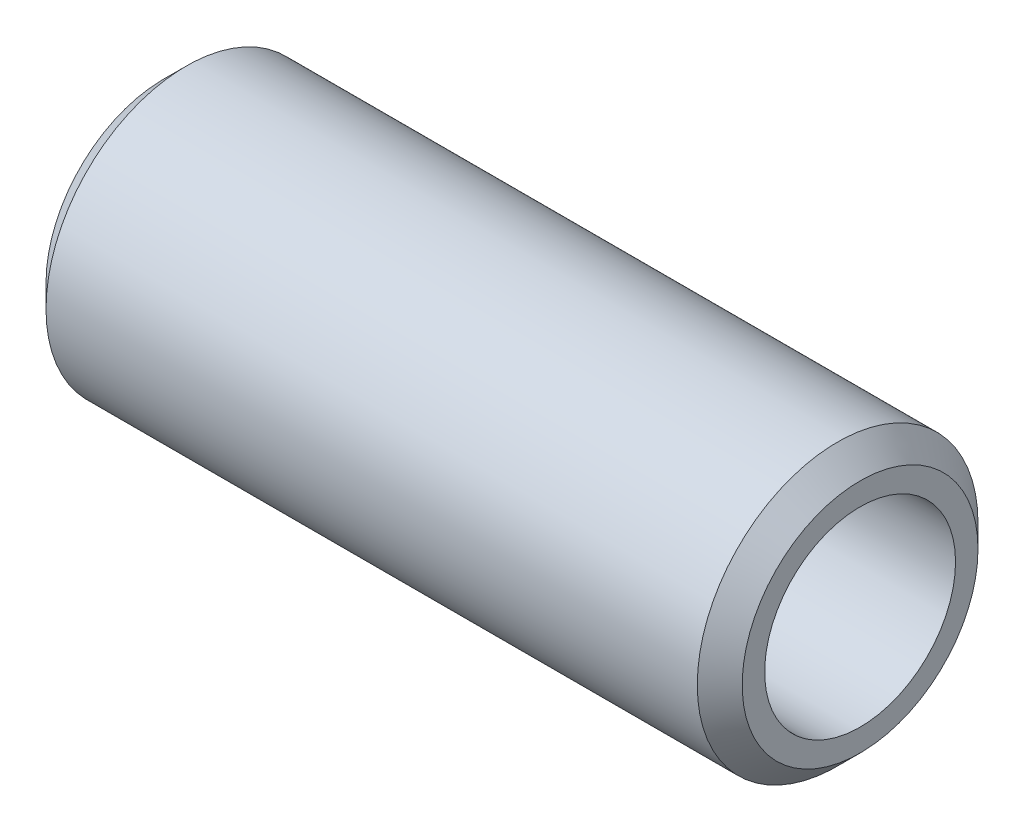
ISO-10303-21;
HEADER;
FILE_DESCRIPTION(('STEP AP214'),'2;1');
FILE_NAME('part.step','',(''),(''),'','','');
FILE_SCHEMA(('AUTOMOTIVE_DESIGN { 1 0 10303 214 1 1 1 1 }'));
ENDSEC;
DATA;
#1=APPLICATION_CONTEXT('core data for automotive mechanical design processes');
#2=APPLICATION_PROTOCOL_DEFINITION('international standard','automotive_design',2000,#1);
#3=PRODUCT_CONTEXT('',#1,'mechanical');
#4=PRODUCT('Part','Part','',(#3));
#5=PRODUCT_RELATED_PRODUCT_CATEGORY('part','',(#4));
#6=PRODUCT_DEFINITION_FORMATION('','',#4);
#7=PRODUCT_DEFINITION_CONTEXT('part definition',#1,'design');
#8=PRODUCT_DEFINITION('design','',#6,#7);
#9=PRODUCT_DEFINITION_SHAPE('','',#8);
#10=(LENGTH_UNIT() NAMED_UNIT(*) SI_UNIT(.MILLI.,.METRE.));
#11=(NAMED_UNIT(*) PLANE_ANGLE_UNIT() SI_UNIT($,.RADIAN.));
#12=(NAMED_UNIT(*) SI_UNIT($,.STERADIAN.) SOLID_ANGLE_UNIT());
#13=UNCERTAINTY_MEASURE_WITH_UNIT(LENGTH_MEASURE(1.E-05),#10,'distance_accuracy_value','');
#14=(GEOMETRIC_REPRESENTATION_CONTEXT(3) GLOBAL_UNCERTAINTY_ASSIGNED_CONTEXT((#13)) GLOBAL_UNIT_ASSIGNED_CONTEXT((#10,
#11,#12)) REPRESENTATION_CONTEXT('',''));
#15=CARTESIAN_POINT('',(0.,0.,0.));
#16=DIRECTION('',(0.,0.,1.));
#17=DIRECTION('',(1.,0.,0.));
#18=AXIS2_PLACEMENT_3D('',#15,#16,#17);
#19=CARTESIAN_POINT('',(-31.,0.,0.));
#20=DIRECTION('',(-1.,0.,0.));
#21=DIRECTION('',(0.,0.,1.));
#22=AXIS2_PLACEMENT_3D('',#19,#20,#21);
#23=PLANE('',#22);
#24=CARTESIAN_POINT('',(-31.,0.,0.));
#25=DIRECTION('',(-1.,0.,0.));
#26=DIRECTION('',(0.,0.,1.));
#27=AXIS2_PLACEMENT_3D('',#24,#25,#26);
#28=CIRCLE('',#27,10.5);
#29=CARTESIAN_POINT('',(-31.,0.,10.5));
#30=VERTEX_POINT('',#29);
#31=EDGE_CURVE('E10',#30,#30,#28,.T.);
#32=ORIENTED_EDGE('',*,*,#31,.T.);
#33=EDGE_LOOP('',(#32));
#34=FACE_BOUND('',#33,.T.);
#35=CARTESIAN_POINT('',(-31.,0.,0.));
#36=DIRECTION('',(1.,0.,0.));
#37=DIRECTION('',(0.,0.,-1.));
#38=AXIS2_PLACEMENT_3D('',#35,#36,#37);
#39=CIRCLE('',#38,8.50000000000001);
#40=CARTESIAN_POINT('',(-31.,0.,-8.50000000000001));
#41=VERTEX_POINT('',#40);
#42=EDGE_CURVE('E68',#41,#41,#39,.T.);
#43=ORIENTED_EDGE('',*,*,#42,.T.);
#44=EDGE_LOOP('',(#43));
#45=FACE_BOUND('',#44,.T.);
#46=ADVANCED_FACE('F43',(#34,#45),#23,.T.);
#47=CARTESIAN_POINT('',(31.,0.,0.));
#48=DIRECTION('',(1.,0.,0.));
#49=DIRECTION('',(0.,0.,-1.));
#50=AXIS2_PLACEMENT_3D('',#47,#48,#49);
#51=CYLINDRICAL_SURFACE('',#50,12.5);
#52=CARTESIAN_POINT('',(29.,0.,0.));
#53=DIRECTION('',(1.,0.,0.));
#54=DIRECTION('',(0.,0.,-1.));
#55=AXIS2_PLACEMENT_3D('',#52,#53,#54);
#56=CIRCLE('',#55,12.5);
#57=CARTESIAN_POINT('',(29.,0.,-12.5));
#58=VERTEX_POINT('',#57);
#59=EDGE_CURVE('E52',#58,#58,#56,.F.);
#60=ORIENTED_EDGE('',*,*,#59,.T.);
#61=EDGE_LOOP('',(#60));
#62=FACE_BOUND('',#61,.T.);
#63=CARTESIAN_POINT('',(-29.,0.,0.));
#64=DIRECTION('',(-1.,0.,0.));
#65=DIRECTION('',(0.,0.,1.));
#66=AXIS2_PLACEMENT_3D('',#63,#64,#65);
#67=CIRCLE('',#66,12.5);
#68=CARTESIAN_POINT('',(-29.,0.,12.5));
#69=VERTEX_POINT('',#68);
#70=EDGE_CURVE('E57',#69,#69,#67,.F.);
#71=ORIENTED_EDGE('',*,*,#70,.T.);
#72=EDGE_LOOP('',(#71));
#73=FACE_BOUND('',#72,.T.);
#74=ADVANCED_FACE('F87',(#62,#73),#51,.T.);
#75=CARTESIAN_POINT('',(31.,12.5,0.));
#76=DIRECTION('',(1.,0.,0.));
#77=DIRECTION('',(0.,0.,-1.));
#78=AXIS2_PLACEMENT_3D('',#75,#76,#77);
#79=PLANE('',#78);
#80=CARTESIAN_POINT('',(31.,0.,0.));
#81=DIRECTION('',(1.,0.,0.));
#82=DIRECTION('',(0.,0.,-1.));
#83=AXIS2_PLACEMENT_3D('',#80,#81,#82);
#84=CIRCLE('',#83,10.5);
#85=CARTESIAN_POINT('',(31.,0.,-10.5));
#86=VERTEX_POINT('',#85);
#87=EDGE_CURVE('E62',#86,#86,#84,.T.);
#88=ORIENTED_EDGE('',*,*,#87,.T.);
#89=EDGE_LOOP('',(#88));
#90=FACE_BOUND('',#89,.T.);
#91=CARTESIAN_POINT('',(31.,0.,0.));
#92=DIRECTION('',(1.,0.,0.));
#93=DIRECTION('',(0.,0.,-1.));
#94=AXIS2_PLACEMENT_3D('',#91,#92,#93);
#95=CIRCLE('',#94,8.50000000000001);
#96=CARTESIAN_POINT('',(31.,0.,-8.50000000000001));
#97=VERTEX_POINT('',#96);
#98=EDGE_CURVE('E69',#97,#97,#95,.T.);
#99=ORIENTED_EDGE('',*,*,#98,.F.);
#100=EDGE_LOOP('',(#99));
#101=FACE_BOUND('',#100,.T.);
#102=ADVANCED_FACE('F82',(#90,#101),#79,.T.);
#103=CARTESIAN_POINT('',(-31.,0.,0.));
#104=DIRECTION('',(1.,0.,0.));
#105=DIRECTION('',(0.,0.,-1.));
#106=AXIS2_PLACEMENT_3D('',#103,#104,#105);
#107=CYLINDRICAL_SURFACE('',#106,8.50000000000001);
#108=ORIENTED_EDGE('',*,*,#42,.F.);
#109=EDGE_LOOP('',(#108));
#110=FACE_BOUND('',#109,.T.);
#111=ORIENTED_EDGE('',*,*,#98,.T.);
#112=EDGE_LOOP('',(#111));
#113=FACE_BOUND('',#112,.T.);
#114=ADVANCED_FACE('F78',(#110,#113),#107,.F.);
#115=CARTESIAN_POINT('',(31.,0.,0.));
#116=DIRECTION('',(-1.,0.,0.));
#117=DIRECTION('',(0.,0.,1.));
#118=AXIS2_PLACEMENT_3D('',#115,#116,#117);
#119=CONICAL_SURFACE('',#118,10.5,0.785398163397445);
#120=ORIENTED_EDGE('',*,*,#59,.F.);
#121=EDGE_LOOP('',(#120));
#122=FACE_BOUND('',#121,.T.);
#123=ORIENTED_EDGE('',*,*,#87,.F.);
#124=EDGE_LOOP('',(#123));
#125=FACE_BOUND('',#124,.T.);
#126=ADVANCED_FACE('F81',(#122,#125),#119,.T.);
#127=CARTESIAN_POINT('',(-29.,0.,0.));
#128=DIRECTION('',(1.,0.,0.));
#129=DIRECTION('',(0.,0.,-1.));
#130=AXIS2_PLACEMENT_3D('',#127,#128,#129);
#131=CONICAL_SURFACE('',#130,12.5,0.785398163397449);
#132=ORIENTED_EDGE('',*,*,#31,.F.);
#133=EDGE_LOOP('',(#132));
#134=FACE_BOUND('',#133,.T.);
#135=ORIENTED_EDGE('',*,*,#70,.F.);
#136=EDGE_LOOP('',(#135));
#137=FACE_BOUND('',#136,.T.);
#138=ADVANCED_FACE('F46',(#134,#137),#131,.T.);
#139=CLOSED_SHELL('',(#46,#74,#102,#114,#126,#138));
#140=MANIFOLD_SOLID_BREP('B2',#139);
#141=ADVANCED_BREP_SHAPE_REPRESENTATION('',(#18,#140),#14);
#142=SHAPE_DEFINITION_REPRESENTATION(#9,#141);
ENDSEC;
END-ISO-10303-21;
